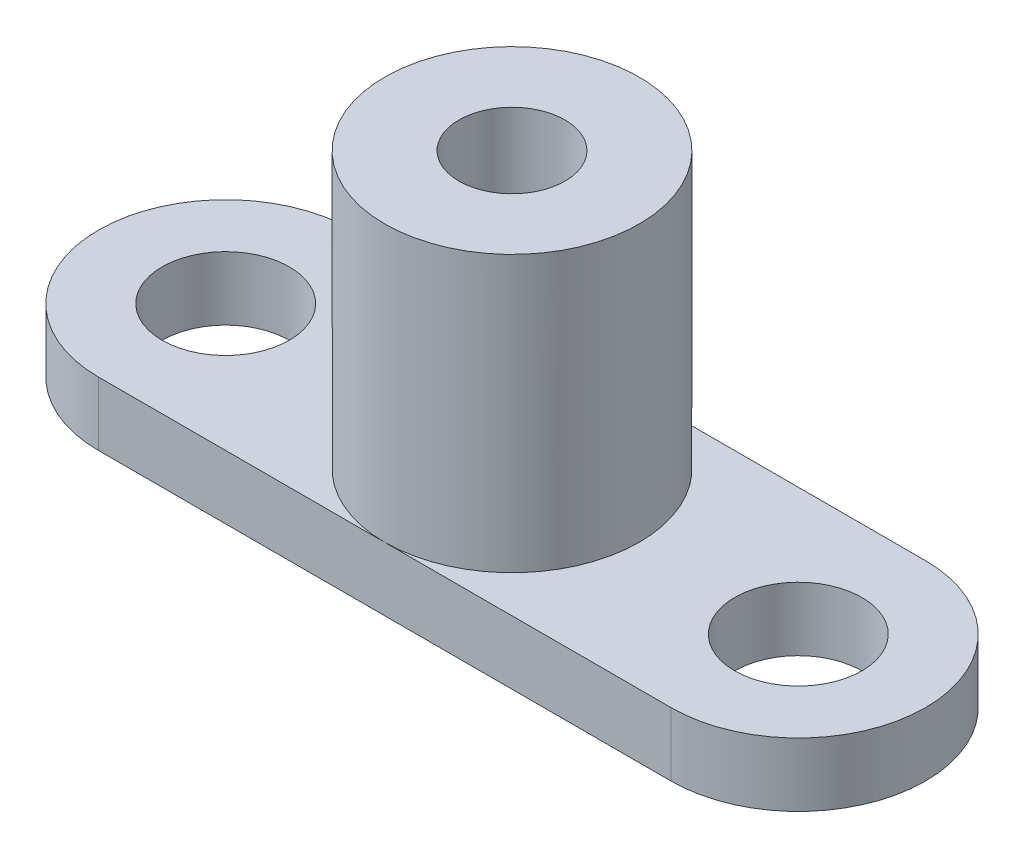
ISO-10303-21;
HEADER;
FILE_DESCRIPTION(('STEP AP214'),'2;1');
FILE_NAME('part.step','',(''),(''),'','','');
FILE_SCHEMA(('AUTOMOTIVE_DESIGN { 1 0 10303 214 1 1 1 1 }'));
ENDSEC;
DATA;
#1=APPLICATION_CONTEXT('core data for automotive mechanical design processes');
#2=APPLICATION_PROTOCOL_DEFINITION('international standard','automotive_design',2000,#1);
#3=PRODUCT_CONTEXT('',#1,'mechanical');
#4=PRODUCT('Part','Part','',(#3));
#5=PRODUCT_RELATED_PRODUCT_CATEGORY('part','',(#4));
#6=PRODUCT_DEFINITION_FORMATION('','',#4);
#7=PRODUCT_DEFINITION_CONTEXT('part definition',#1,'design');
#8=PRODUCT_DEFINITION('design','',#6,#7);
#9=PRODUCT_DEFINITION_SHAPE('','',#8);
#10=(LENGTH_UNIT() NAMED_UNIT(*) SI_UNIT(.MILLI.,.METRE.));
#11=(NAMED_UNIT(*) PLANE_ANGLE_UNIT() SI_UNIT($,.RADIAN.));
#12=(NAMED_UNIT(*) SI_UNIT($,.STERADIAN.) SOLID_ANGLE_UNIT());
#13=UNCERTAINTY_MEASURE_WITH_UNIT(LENGTH_MEASURE(1.E-05),#10,'distance_accuracy_value','');
#14=(GEOMETRIC_REPRESENTATION_CONTEXT(3) GLOBAL_UNCERTAINTY_ASSIGNED_CONTEXT((#13)) GLOBAL_UNIT_ASSIGNED_CONTEXT((#10,
#11,#12)) REPRESENTATION_CONTEXT('',''));
#15=CARTESIAN_POINT('',(0.,0.,0.));
#16=DIRECTION('',(0.,0.,1.));
#17=DIRECTION('',(1.,0.,0.));
#18=AXIS2_PLACEMENT_3D('',#15,#16,#17);
#19=CARTESIAN_POINT('',(0.,3.,0.));
#20=DIRECTION('',(0.,1.,0.));
#21=DIRECTION('',(0.,0.,1.));
#22=AXIS2_PLACEMENT_3D('',#19,#20,#21);
#23=PLANE('',#22);
#24=CARTESIAN_POINT('',(13.5,3.,0.));
#25=DIRECTION('',(0.,1.,0.));
#26=DIRECTION('',(0.,0.,1.));
#27=AXIS2_PLACEMENT_3D('',#24,#25,#26);
#28=CIRCLE('',#27,3.);
#29=CARTESIAN_POINT('',(13.5,3.,3.));
#30=VERTEX_POINT('',#29);
#31=EDGE_CURVE('E148',#30,#30,#28,.T.);
#32=ORIENTED_EDGE('',*,*,#31,.F.);
#33=EDGE_LOOP('',(#32));
#34=FACE_BOUND('',#33,.T.);
#35=CARTESIAN_POINT('',(0.,3.,0.));
#36=DIRECTION('',(0.,1.,0.));
#37=DIRECTION('',(0.,0.,1.));
#38=AXIS2_PLACEMENT_3D('',#35,#36,#37);
#39=CIRCLE('',#38,6.);
#40=CARTESIAN_POINT('',(0.,3.,6.));
#41=VERTEX_POINT('',#40);
#42=CARTESIAN_POINT('',(0.,3.,-6.));
#43=VERTEX_POINT('',#42);
#44=EDGE_CURVE('E52',#41,#43,#39,.T.);
#45=ORIENTED_EDGE('',*,*,#44,.F.);
#46=DIRECTION('',(1.,0.,0.));
#47=VECTOR('',#46,1.);
#48=CARTESIAN_POINT('',(0.,3.,6.));
#49=LINE('',#48,#47);
#50=CARTESIAN_POINT('',(13.5,3.,6.));
#51=VERTEX_POINT('',#50);
#52=EDGE_CURVE('E121',#41,#51,#49,.T.);
#53=ORIENTED_EDGE('',*,*,#52,.T.);
#54=CARTESIAN_POINT('',(13.5,3.,0.));
#55=DIRECTION('',(0.,1.,0.));
#56=DIRECTION('',(0.,0.,1.));
#57=AXIS2_PLACEMENT_3D('',#54,#55,#56);
#58=CIRCLE('',#57,6.);
#59=CARTESIAN_POINT('',(13.5,3.,-6.));
#60=VERTEX_POINT('',#59);
#61=EDGE_CURVE('E124',#51,#60,#58,.T.);
#62=ORIENTED_EDGE('',*,*,#61,.T.);
#63=DIRECTION('',(1.,0.,0.));
#64=VECTOR('',#63,1.);
#65=CARTESIAN_POINT('',(0.,3.,-6.));
#66=LINE('',#65,#64);
#67=EDGE_CURVE('E65',#43,#60,#66,.T.);
#68=ORIENTED_EDGE('',*,*,#67,.F.);
#69=EDGE_LOOP('',(#45,#53,#62,#68));
#70=FACE_BOUND('',#69,.T.);
#71=ADVANCED_FACE('F41',(#34,#70),#23,.T.);
#72=CARTESIAN_POINT('',(0.,3.,-6.));
#73=DIRECTION('',(0.,0.,-1.));
#74=DIRECTION('',(-1.,0.,0.));
#75=AXIS2_PLACEMENT_3D('',#72,#73,#74);
#76=PLANE('',#75);
#77=DIRECTION('',(1.,0.,0.));
#78=VECTOR('',#77,1.);
#79=CARTESIAN_POINT('',(0.,0.,-6.));
#80=LINE('',#79,#78);
#81=CARTESIAN_POINT('',(-13.5,0.,-6.));
#82=VERTEX_POINT('',#81);
#83=CARTESIAN_POINT('',(13.5,0.,-6.));
#84=VERTEX_POINT('',#83);
#85=EDGE_CURVE('E115',#82,#84,#80,.T.);
#86=ORIENTED_EDGE('',*,*,#85,.F.);
#87=DIRECTION('',(0.,-1.,0.));
#88=VECTOR('',#87,1.);
#89=CARTESIAN_POINT('',(-13.5,3.,-6.));
#90=LINE('',#89,#88);
#91=CARTESIAN_POINT('',(-13.5,3.,-6.));
#92=VERTEX_POINT('',#91);
#93=EDGE_CURVE('E50',#92,#82,#90,.T.);
#94=ORIENTED_EDGE('',*,*,#93,.F.);
#95=EDGE_CURVE('E117',#92,#43,#66,.T.);
#96=ORIENTED_EDGE('',*,*,#95,.T.);
#97=ORIENTED_EDGE('',*,*,#67,.T.);
#98=DIRECTION('',(0.,-1.,0.));
#99=VECTOR('',#98,1.);
#100=CARTESIAN_POINT('',(13.5,3.,-6.));
#101=LINE('',#100,#99);
#102=EDGE_CURVE('E85',#60,#84,#101,.T.);
#103=ORIENTED_EDGE('',*,*,#102,.T.);
#104=EDGE_LOOP('',(#86,#94,#96,#97,#103));
#105=FACE_BOUND('',#104,.T.);
#106=ADVANCED_FACE('F43',(#105),#76,.T.);
#107=CARTESIAN_POINT('',(-13.5,3.,0.));
#108=DIRECTION('',(0.,-1.,0.));
#109=DIRECTION('',(0.,0.,-1.));
#110=AXIS2_PLACEMENT_3D('',#107,#108,#109);
#111=CYLINDRICAL_SURFACE('',#110,6.);
#112=CARTESIAN_POINT('',(-13.5,0.,0.));
#113=DIRECTION('',(0.,1.,0.));
#114=DIRECTION('',(0.,0.,1.));
#115=AXIS2_PLACEMENT_3D('',#112,#113,#114);
#116=CIRCLE('',#115,6.);
#117=CARTESIAN_POINT('',(-13.5,0.,6.));
#118=VERTEX_POINT('',#117);
#119=EDGE_CURVE('E128',#82,#118,#116,.T.);
#120=ORIENTED_EDGE('',*,*,#119,.T.);
#121=DIRECTION('',(0.,-1.,0.));
#122=VECTOR('',#121,1.);
#123=CARTESIAN_POINT('',(-13.5,3.,6.));
#124=LINE('',#123,#122);
#125=CARTESIAN_POINT('',(-13.5,3.,6.));
#126=VERTEX_POINT('',#125);
#127=EDGE_CURVE('E138',#126,#118,#124,.T.);
#128=ORIENTED_EDGE('',*,*,#127,.F.);
#129=CARTESIAN_POINT('',(-13.5,3.,0.));
#130=DIRECTION('',(0.,1.,0.));
#131=DIRECTION('',(0.,0.,1.));
#132=AXIS2_PLACEMENT_3D('',#129,#130,#131);
#133=CIRCLE('',#132,6.);
#134=EDGE_CURVE('E119',#92,#126,#133,.T.);
#135=ORIENTED_EDGE('',*,*,#134,.F.);
#136=ORIENTED_EDGE('',*,*,#93,.T.);
#137=EDGE_LOOP('',(#120,#128,#135,#136));
#138=FACE_BOUND('',#137,.T.);
#139=ADVANCED_FACE('F189',(#138),#111,.T.);
#140=CARTESIAN_POINT('',(0.,3.,6.));
#141=DIRECTION('',(0.,0.,-1.));
#142=DIRECTION('',(-1.,0.,0.));
#143=AXIS2_PLACEMENT_3D('',#140,#141,#142);
#144=PLANE('',#143);
#145=DIRECTION('',(1.,0.,0.));
#146=VECTOR('',#145,1.);
#147=CARTESIAN_POINT('',(0.,0.,6.));
#148=LINE('',#147,#146);
#149=CARTESIAN_POINT('',(13.5,0.,6.));
#150=VERTEX_POINT('',#149);
#151=EDGE_CURVE('E130',#118,#150,#148,.T.);
#152=ORIENTED_EDGE('',*,*,#151,.T.);
#153=DIRECTION('',(0.,-1.,0.));
#154=VECTOR('',#153,1.);
#155=CARTESIAN_POINT('',(13.5,3.,6.));
#156=LINE('',#155,#154);
#157=EDGE_CURVE('E135',#51,#150,#156,.T.);
#158=ORIENTED_EDGE('',*,*,#157,.F.);
#159=ORIENTED_EDGE('',*,*,#52,.F.);
#160=EDGE_CURVE('E122',#126,#41,#49,.T.);
#161=ORIENTED_EDGE('',*,*,#160,.F.);
#162=ORIENTED_EDGE('',*,*,#127,.T.);
#163=EDGE_LOOP('',(#152,#158,#159,#161,#162));
#164=FACE_BOUND('',#163,.T.);
#165=ADVANCED_FACE('F186',(#164),#144,.F.);
#166=CARTESIAN_POINT('',(13.5,3.,0.));
#167=DIRECTION('',(0.,-1.,0.));
#168=DIRECTION('',(0.,0.,-1.));
#169=AXIS2_PLACEMENT_3D('',#166,#167,#168);
#170=CYLINDRICAL_SURFACE('',#169,6.);
#171=CARTESIAN_POINT('',(13.5,0.,0.));
#172=DIRECTION('',(0.,1.,0.));
#173=DIRECTION('',(0.,0.,1.));
#174=AXIS2_PLACEMENT_3D('',#171,#172,#173);
#175=CIRCLE('',#174,6.);
#176=EDGE_CURVE('E132',#150,#84,#175,.T.);
#177=ORIENTED_EDGE('',*,*,#176,.T.);
#178=ORIENTED_EDGE('',*,*,#102,.F.);
#179=ORIENTED_EDGE('',*,*,#61,.F.);
#180=ORIENTED_EDGE('',*,*,#157,.T.);
#181=EDGE_LOOP('',(#177,#178,#179,#180));
#182=FACE_BOUND('',#181,.T.);
#183=ADVANCED_FACE('F181',(#182),#170,.T.);
#184=CARTESIAN_POINT('',(-13.5,3.,0.));
#185=DIRECTION('',(0.,1.,0.));
#186=DIRECTION('',(0.,0.,1.));
#187=AXIS2_PLACEMENT_3D('',#184,#185,#186);
#188=CIRCLE('',#187,3.);
#189=CARTESIAN_POINT('',(-13.5,3.,3.));
#190=VERTEX_POINT('',#189);
#191=EDGE_CURVE('E143',#190,#190,#188,.T.);
#192=ORIENTED_EDGE('',*,*,#191,.F.);
#193=EDGE_LOOP('',(#192));
#194=FACE_BOUND('',#193,.T.);
#195=EDGE_CURVE('E11',#43,#41,#39,.T.);
#196=ORIENTED_EDGE('',*,*,#195,.F.);
#197=ORIENTED_EDGE('',*,*,#95,.F.);
#198=ORIENTED_EDGE('',*,*,#134,.T.);
#199=ORIENTED_EDGE('',*,*,#160,.T.);
#200=EDGE_LOOP('',(#196,#197,#198,#199));
#201=FACE_BOUND('',#200,.T.);
#202=ADVANCED_FACE('F161',(#194,#201),#23,.T.);
#203=CARTESIAN_POINT('',(0.,0.,0.));
#204=DIRECTION('',(0.,1.,0.));
#205=DIRECTION('',(0.,0.,1.));
#206=AXIS2_PLACEMENT_3D('',#203,#204,#205);
#207=PLANE('',#206);
#208=CARTESIAN_POINT('',(-13.5,0.,0.));
#209=DIRECTION('',(0.,1.,0.));
#210=DIRECTION('',(0.,0.,1.));
#211=AXIS2_PLACEMENT_3D('',#208,#209,#210);
#212=CIRCLE('',#211,3.);
#213=CARTESIAN_POINT('',(-13.5,0.,3.));
#214=VERTEX_POINT('',#213);
#215=EDGE_CURVE('E45',#214,#214,#212,.T.);
#216=ORIENTED_EDGE('',*,*,#215,.T.);
#217=EDGE_LOOP('',(#216));
#218=FACE_BOUND('',#217,.T.);
#219=CARTESIAN_POINT('',(13.5,0.,0.));
#220=DIRECTION('',(0.,1.,0.));
#221=DIRECTION('',(0.,0.,1.));
#222=AXIS2_PLACEMENT_3D('',#219,#220,#221);
#223=CIRCLE('',#222,3.);
#224=CARTESIAN_POINT('',(13.5,0.,3.));
#225=VERTEX_POINT('',#224);
#226=EDGE_CURVE('E141',#225,#225,#223,.T.);
#227=ORIENTED_EDGE('',*,*,#226,.T.);
#228=EDGE_LOOP('',(#227));
#229=FACE_BOUND('',#228,.T.);
#230=ORIENTED_EDGE('',*,*,#85,.T.);
#231=ORIENTED_EDGE('',*,*,#176,.F.);
#232=ORIENTED_EDGE('',*,*,#151,.F.);
#233=ORIENTED_EDGE('',*,*,#119,.F.);
#234=EDGE_LOOP('',(#230,#231,#232,#233));
#235=FACE_BOUND('',#234,.T.);
#236=ADVANCED_FACE('F168',(#218,#229,#235),#207,.F.);
#237=CARTESIAN_POINT('',(0.,16.,0.));
#238=DIRECTION('',(0.,-1.,0.));
#239=DIRECTION('',(0.,0.,-1.));
#240=AXIS2_PLACEMENT_3D('',#237,#238,#239);
#241=CYLINDRICAL_SURFACE('',#240,6.);
#242=CARTESIAN_POINT('',(0.,16.,0.));
#243=DIRECTION('',(0.,1.,0.));
#244=DIRECTION('',(0.,0.,1.));
#245=AXIS2_PLACEMENT_3D('',#242,#243,#244);
#246=CIRCLE('',#245,6.);
#247=CARTESIAN_POINT('',(0.,16.,6.));
#248=VERTEX_POINT('',#247);
#249=EDGE_CURVE('E109',#248,#248,#246,.T.);
#250=ORIENTED_EDGE('',*,*,#249,.F.);
#251=EDGE_LOOP('',(#250));
#252=FACE_BOUND('',#251,.T.);
#253=ORIENTED_EDGE('',*,*,#44,.T.);
#254=ORIENTED_EDGE('',*,*,#195,.T.);
#255=EDGE_LOOP('',(#253,#254));
#256=FACE_BOUND('',#255,.T.);
#257=ADVANCED_FACE('F166',(#252,#256),#241,.T.);
#258=CARTESIAN_POINT('',(0.,16.,0.));
#259=DIRECTION('',(0.,1.,0.));
#260=DIRECTION('',(0.,0.,1.));
#261=AXIS2_PLACEMENT_3D('',#258,#259,#260);
#262=PLANE('',#261);
#263=CARTESIAN_POINT('',(0.,16.,0.));
#264=DIRECTION('',(0.,1.,0.));
#265=DIRECTION('',(0.,0.,1.));
#266=AXIS2_PLACEMENT_3D('',#263,#264,#265);
#267=CIRCLE('',#266,2.49999999999999);
#268=CARTESIAN_POINT('',(0.,16.,2.49999999999999));
#269=VERTEX_POINT('',#268);
#270=EDGE_CURVE('E106',#269,#269,#267,.T.);
#271=ORIENTED_EDGE('',*,*,#270,.F.);
#272=EDGE_LOOP('',(#271));
#273=FACE_BOUND('',#272,.T.);
#274=ORIENTED_EDGE('',*,*,#249,.T.);
#275=EDGE_LOOP('',(#274));
#276=FACE_BOUND('',#275,.T.);
#277=ADVANCED_FACE('F100',(#273,#276),#262,.T.);
#278=CARTESIAN_POINT('',(0.,4.,0.));
#279=DIRECTION('',(0.,1.,0.));
#280=DIRECTION('',(0.,0.,1.));
#281=AXIS2_PLACEMENT_3D('',#278,#279,#280);
#282=CONICAL_SURFACE('',#281,2.5,1.02974425867665);
#283=CARTESIAN_POINT('',(0.,2.4978484524311,0.));
#284=VERTEX_POINT('',#283);
#285=VERTEX_LOOP('',#284);
#286=FACE_BOUND('',#285,.T.);
#287=CARTESIAN_POINT('',(0.,4.,0.));
#288=DIRECTION('',(0.,1.,0.));
#289=DIRECTION('',(0.,0.,1.));
#290=AXIS2_PLACEMENT_3D('',#287,#288,#289);
#291=CIRCLE('',#290,2.5);
#292=CARTESIAN_POINT('',(0.,4.,2.5));
#293=VERTEX_POINT('',#292);
#294=EDGE_CURVE('E104',#293,#293,#291,.T.);
#295=ORIENTED_EDGE('',*,*,#294,.T.);
#296=EDGE_LOOP('',(#295));
#297=FACE_BOUND('',#296,.T.);
#298=ADVANCED_FACE('F96',(#286,#297),#282,.F.);
#299=CARTESIAN_POINT('',(0.,16.,0.));
#300=DIRECTION('',(0.,1.,0.));
#301=DIRECTION('',(0.,0.,1.));
#302=AXIS2_PLACEMENT_3D('',#299,#300,#301);
#303=CYLINDRICAL_SURFACE('',#302,2.49999999999999);
#304=ORIENTED_EDGE('',*,*,#294,.F.);
#305=EDGE_LOOP('',(#304));
#306=FACE_BOUND('',#305,.T.);
#307=ORIENTED_EDGE('',*,*,#270,.T.);
#308=EDGE_LOOP('',(#307));
#309=FACE_BOUND('',#308,.T.);
#310=ADVANCED_FACE('F99',(#306,#309),#303,.F.);
#311=CARTESIAN_POINT('',(13.5,-7.,0.));
#312=DIRECTION('',(0.,1.,0.));
#313=DIRECTION('',(0.,0.,1.));
#314=AXIS2_PLACEMENT_3D('',#311,#312,#313);
#315=CYLINDRICAL_SURFACE('',#314,3.);
#316=ORIENTED_EDGE('',*,*,#31,.T.);
#317=EDGE_LOOP('',(#316));
#318=FACE_BOUND('',#317,.T.);
#319=ORIENTED_EDGE('',*,*,#226,.F.);
#320=EDGE_LOOP('',(#319));
#321=FACE_BOUND('',#320,.T.);
#322=ADVANCED_FACE('F155',(#318,#321),#315,.F.);
#323=CARTESIAN_POINT('',(-13.5,-7.,0.));
#324=DIRECTION('',(0.,1.,0.));
#325=DIRECTION('',(0.,0.,1.));
#326=AXIS2_PLACEMENT_3D('',#323,#324,#325);
#327=CYLINDRICAL_SURFACE('',#326,3.);
#328=ORIENTED_EDGE('',*,*,#191,.T.);
#329=EDGE_LOOP('',(#328));
#330=FACE_BOUND('',#329,.T.);
#331=ORIENTED_EDGE('',*,*,#215,.F.);
#332=EDGE_LOOP('',(#331));
#333=FACE_BOUND('',#332,.T.);
#334=ADVANCED_FACE('F243',(#330,#333),#327,.F.);
#335=CLOSED_SHELL('',(#71,#106,#139,#165,#183,#202,#236,#257,#277,#298,#310,#322,#334));
#336=MANIFOLD_SOLID_BREP('B2',#335);
#337=ADVANCED_BREP_SHAPE_REPRESENTATION('',(#18,#336),#14);
#338=SHAPE_DEFINITION_REPRESENTATION(#9,#337);
ENDSEC;
END-ISO-10303-21;
